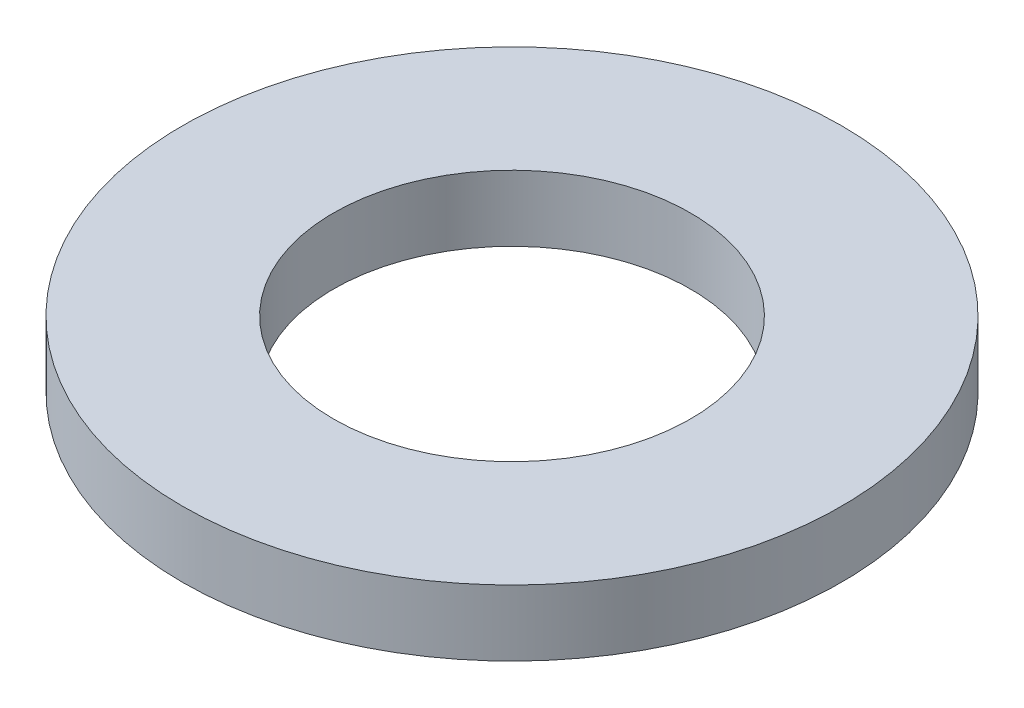
ISO-10303-21;
HEADER;
FILE_DESCRIPTION(('STEP AP214'),'2;1');
FILE_NAME('part.step','',(''),(''),'','','');
FILE_SCHEMA(('AUTOMOTIVE_DESIGN { 1 0 10303 214 1 1 1 1 }'));
ENDSEC;
DATA;
#1=APPLICATION_CONTEXT('core data for automotive mechanical design processes');
#2=APPLICATION_PROTOCOL_DEFINITION('international standard','automotive_design',2000,#1);
#3=PRODUCT_CONTEXT('',#1,'mechanical');
#4=PRODUCT('Part','Part','',(#3));
#5=PRODUCT_RELATED_PRODUCT_CATEGORY('part','',(#4));
#6=PRODUCT_DEFINITION_FORMATION('','',#4);
#7=PRODUCT_DEFINITION_CONTEXT('part definition',#1,'design');
#8=PRODUCT_DEFINITION('design','',#6,#7);
#9=PRODUCT_DEFINITION_SHAPE('','',#8);
#10=(LENGTH_UNIT() NAMED_UNIT(*) SI_UNIT(.MILLI.,.METRE.));
#11=(NAMED_UNIT(*) PLANE_ANGLE_UNIT() SI_UNIT($,.RADIAN.));
#12=(NAMED_UNIT(*) SI_UNIT($,.STERADIAN.) SOLID_ANGLE_UNIT());
#13=UNCERTAINTY_MEASURE_WITH_UNIT(LENGTH_MEASURE(1.E-05),#10,'distance_accuracy_value','');
#14=(GEOMETRIC_REPRESENTATION_CONTEXT(3) GLOBAL_UNCERTAINTY_ASSIGNED_CONTEXT((#13)) GLOBAL_UNIT_ASSIGNED_CONTEXT((#10,
#11,#12)) REPRESENTATION_CONTEXT('',''));
#15=CARTESIAN_POINT('',(0.,0.,0.));
#16=DIRECTION('',(0.,0.,1.));
#17=DIRECTION('',(1.,0.,0.));
#18=AXIS2_PLACEMENT_3D('',#15,#16,#17);
#19=CARTESIAN_POINT('',(0.,12.,0.));
#20=DIRECTION('',(0.,-1.,0.));
#21=DIRECTION('',(0.,0.,-1.));
#22=AXIS2_PLACEMENT_3D('',#19,#20,#21);
#23=CYLINDRICAL_SURFACE('',#22,60.);
#24=CARTESIAN_POINT('',(0.,12.,0.));
#25=DIRECTION('',(0.,1.,0.));
#26=DIRECTION('',(0.,0.,1.));
#27=AXIS2_PLACEMENT_3D('',#24,#25,#26);
#28=CIRCLE('',#27,60.);
#29=CARTESIAN_POINT('',(0.,12.,60.));
#30=VERTEX_POINT('',#29);
#31=EDGE_CURVE('E10',#30,#30,#28,.T.);
#32=ORIENTED_EDGE('',*,*,#31,.F.);
#33=EDGE_LOOP('',(#32));
#34=FACE_BOUND('',#33,.T.);
#35=CARTESIAN_POINT('',(0.,0.,0.));
#36=DIRECTION('',(0.,1.,0.));
#37=DIRECTION('',(0.,0.,1.));
#38=AXIS2_PLACEMENT_3D('',#35,#36,#37);
#39=CIRCLE('',#38,60.);
#40=CARTESIAN_POINT('',(0.,0.,60.));
#41=VERTEX_POINT('',#40);
#42=EDGE_CURVE('E37',#41,#41,#39,.T.);
#43=ORIENTED_EDGE('',*,*,#42,.T.);
#44=EDGE_LOOP('',(#43));
#45=FACE_BOUND('',#44,.T.);
#46=ADVANCED_FACE('F40',(#34,#45),#23,.T.);
#47=CARTESIAN_POINT('',(0.,12.,0.));
#48=DIRECTION('',(0.,1.,0.));
#49=DIRECTION('',(0.,0.,1.));
#50=AXIS2_PLACEMENT_3D('',#47,#48,#49);
#51=PLANE('',#50);
#52=CARTESIAN_POINT('',(0.,12.,0.));
#53=DIRECTION('',(0.,1.,0.));
#54=DIRECTION('',(0.,0.,1.));
#55=AXIS2_PLACEMENT_3D('',#52,#53,#54);
#56=CIRCLE('',#55,32.5);
#57=CARTESIAN_POINT('',(0.,12.,32.5));
#58=VERTEX_POINT('',#57);
#59=EDGE_CURVE('E50',#58,#58,#56,.T.);
#60=ORIENTED_EDGE('',*,*,#59,.F.);
#61=EDGE_LOOP('',(#60));
#62=FACE_BOUND('',#61,.T.);
#63=ORIENTED_EDGE('',*,*,#31,.T.);
#64=EDGE_LOOP('',(#63));
#65=FACE_BOUND('',#64,.T.);
#66=ADVANCED_FACE('F59',(#62,#65),#51,.T.);
#67=CARTESIAN_POINT('',(0.,0.,0.));
#68=DIRECTION('',(0.,1.,0.));
#69=DIRECTION('',(0.,0.,1.));
#70=AXIS2_PLACEMENT_3D('',#67,#68,#69);
#71=PLANE('',#70);
#72=CARTESIAN_POINT('',(0.,0.,0.));
#73=DIRECTION('',(0.,1.,0.));
#74=DIRECTION('',(0.,0.,1.));
#75=AXIS2_PLACEMENT_3D('',#72,#73,#74);
#76=CIRCLE('',#75,32.5);
#77=CARTESIAN_POINT('',(0.,0.,32.5));
#78=VERTEX_POINT('',#77);
#79=EDGE_CURVE('E47',#78,#78,#76,.T.);
#80=ORIENTED_EDGE('',*,*,#79,.T.);
#81=EDGE_LOOP('',(#80));
#82=FACE_BOUND('',#81,.T.);
#83=ORIENTED_EDGE('',*,*,#42,.F.);
#84=EDGE_LOOP('',(#83));
#85=FACE_BOUND('',#84,.T.);
#86=ADVANCED_FACE('F58',(#82,#85),#71,.F.);
#87=CARTESIAN_POINT('',(0.,12.,0.));
#88=DIRECTION('',(0.,-1.,0.));
#89=DIRECTION('',(0.,0.,-1.));
#90=AXIS2_PLACEMENT_3D('',#87,#88,#89);
#91=CYLINDRICAL_SURFACE('',#90,32.5);
#92=ORIENTED_EDGE('',*,*,#59,.T.);
#93=EDGE_LOOP('',(#92));
#94=FACE_BOUND('',#93,.T.);
#95=ORIENTED_EDGE('',*,*,#79,.F.);
#96=EDGE_LOOP('',(#95));
#97=FACE_BOUND('',#96,.T.);
#98=ADVANCED_FACE('F54',(#94,#97),#91,.F.);
#99=CLOSED_SHELL('',(#46,#66,#86,#98));
#100=MANIFOLD_SOLID_BREP('B2',#99);
#101=ADVANCED_BREP_SHAPE_REPRESENTATION('',(#18,#100),#14);
#102=SHAPE_DEFINITION_REPRESENTATION(#9,#101);
ENDSEC;
END-ISO-10303-21;
